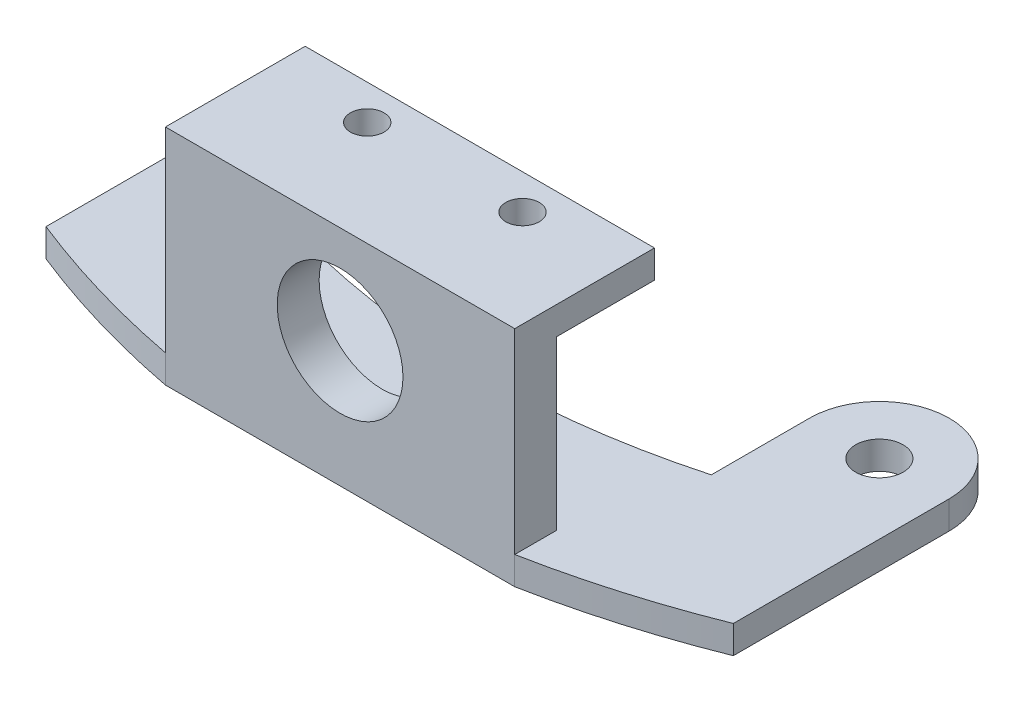
ISO-10303-21;
HEADER;
FILE_DESCRIPTION(('STEP AP214'),'2;1');
FILE_NAME('part.step','',(''),(''),'','','');
FILE_SCHEMA(('AUTOMOTIVE_DESIGN { 1 0 10303 214 1 1 1 1 }'));
ENDSEC;
DATA;
#1=APPLICATION_CONTEXT('core data for automotive mechanical design processes');
#2=APPLICATION_PROTOCOL_DEFINITION('international standard','automotive_design',2000,#1);
#3=PRODUCT_CONTEXT('',#1,'mechanical');
#4=PRODUCT('Part','Part','',(#3));
#5=PRODUCT_RELATED_PRODUCT_CATEGORY('part','',(#4));
#6=PRODUCT_DEFINITION_FORMATION('','',#4);
#7=PRODUCT_DEFINITION_CONTEXT('part definition',#1,'design');
#8=PRODUCT_DEFINITION('design','',#6,#7);
#9=PRODUCT_DEFINITION_SHAPE('','',#8);
#10=(LENGTH_UNIT() NAMED_UNIT(*) SI_UNIT(.MILLI.,.METRE.));
#11=(NAMED_UNIT(*) PLANE_ANGLE_UNIT() SI_UNIT($,.RADIAN.));
#12=(NAMED_UNIT(*) SI_UNIT($,.STERADIAN.) SOLID_ANGLE_UNIT());
#13=UNCERTAINTY_MEASURE_WITH_UNIT(LENGTH_MEASURE(1.E-05),#10,'distance_accuracy_value','');
#14=(GEOMETRIC_REPRESENTATION_CONTEXT(3) GLOBAL_UNCERTAINTY_ASSIGNED_CONTEXT((#13)) GLOBAL_UNIT_ASSIGNED_CONTEXT((#10,
#11,#12)) REPRESENTATION_CONTEXT('',''));
#15=CARTESIAN_POINT('',(0.,0.,0.));
#16=DIRECTION('',(0.,0.,1.));
#17=DIRECTION('',(1.,0.,0.));
#18=AXIS2_PLACEMENT_3D('',#15,#16,#17);
#19=CARTESIAN_POINT('',(-14.5959179422655,-2.,0.));
#20=DIRECTION('',(-1.,0.,0.));
#21=DIRECTION('',(0.,0.,1.));
#22=AXIS2_PLACEMENT_3D('',#19,#20,#21);
#23=PLANE('',#22);
#24=DIRECTION('',(0.,0.,1.));
#25=VECTOR('',#24,1.);
#26=CARTESIAN_POINT('',(-14.5959179422655,0.,0.));
#27=LINE('',#26,#25);
#28=CARTESIAN_POINT('',(-14.5959179422654,0.,46.));
#29=VERTEX_POINT('',#28);
#30=CARTESIAN_POINT('',(-14.5959179422654,0.,53.0279094385462));
#31=VERTEX_POINT('',#30);
#32=EDGE_CURVE('E196',#29,#31,#27,.T.);
#33=ORIENTED_EDGE('',*,*,#32,.T.);
#34=DIRECTION('',(0.,1.,0.));
#35=VECTOR('',#34,1.);
#36=CARTESIAN_POINT('',(-14.5959179422654,-2.,53.0279094385462));
#37=LINE('',#36,#35);
#38=CARTESIAN_POINT('',(-14.5959179422654,-2.,53.0279094385462));
#39=VERTEX_POINT('',#38);
#40=EDGE_CURVE('E11',#39,#31,#37,.T.);
#41=ORIENTED_EDGE('',*,*,#40,.F.);
#42=DIRECTION('',(0.,0.,1.));
#43=VECTOR('',#42,1.);
#44=CARTESIAN_POINT('',(-14.5959179422655,-2.,0.));
#45=LINE('',#44,#43);
#46=CARTESIAN_POINT('',(-14.5959179422654,-2.,46.));
#47=VERTEX_POINT('',#46);
#48=EDGE_CURVE('E197',#47,#39,#45,.T.);
#49=ORIENTED_EDGE('',*,*,#48,.F.);
#50=DIRECTION('',(0.,1.,0.));
#51=VECTOR('',#50,1.);
#52=CARTESIAN_POINT('',(-14.5959179422654,-2.,46.));
#53=LINE('',#52,#51);
#54=EDGE_CURVE('E39',#47,#29,#53,.T.);
#55=ORIENTED_EDGE('',*,*,#54,.T.);
#56=EDGE_LOOP('',(#33,#41,#49,#55));
#57=FACE_BOUND('',#56,.T.);
#58=ADVANCED_FACE('F36',(#57),#23,.F.);
#59=CARTESIAN_POINT('',(0.,-2.,0.));
#60=DIRECTION('',(0.,1.,0.));
#61=DIRECTION('',(0.,0.,1.));
#62=AXIS2_PLACEMENT_3D('',#59,#60,#61);
#63=CYLINDRICAL_SURFACE('',#62,55.);
#64=CARTESIAN_POINT('',(0.,0.,0.));
#65=DIRECTION('',(0.,1.,0.));
#66=DIRECTION('',(0.,0.,1.));
#67=AXIS2_PLACEMENT_3D('',#64,#65,#66);
#68=CIRCLE('',#67,55.);
#69=CARTESIAN_POINT('',(14.5959179422654,0.,53.0279094385462));
#70=VERTEX_POINT('',#69);
#71=EDGE_CURVE('E253',#31,#70,#68,.T.);
#72=ORIENTED_EDGE('',*,*,#71,.T.);
#73=DIRECTION('',(0.,1.,0.));
#74=VECTOR('',#73,1.);
#75=CARTESIAN_POINT('',(14.5959179422654,-2.,53.0279094385462));
#76=LINE('',#75,#74);
#77=CARTESIAN_POINT('',(14.5959179422654,-2.,53.0279094385462));
#78=VERTEX_POINT('',#77);
#79=EDGE_CURVE('E44',#78,#70,#76,.T.);
#80=ORIENTED_EDGE('',*,*,#79,.F.);
#81=CARTESIAN_POINT('',(0.,-2.,0.));
#82=DIRECTION('',(0.,1.,0.));
#83=DIRECTION('',(0.,0.,1.));
#84=AXIS2_PLACEMENT_3D('',#81,#82,#83);
#85=CIRCLE('',#84,55.);
#86=EDGE_CURVE('E223',#39,#78,#85,.T.);
#87=ORIENTED_EDGE('',*,*,#86,.F.);
#88=ORIENTED_EDGE('',*,*,#40,.T.);
#89=EDGE_LOOP('',(#72,#80,#87,#88));
#90=FACE_BOUND('',#89,.T.);
#91=ADVANCED_FACE('F305',(#90),#63,.F.);
#92=CARTESIAN_POINT('',(14.5959179422655,-2.,0.));
#93=DIRECTION('',(-1.,0.,0.));
#94=DIRECTION('',(0.,0.,1.));
#95=AXIS2_PLACEMENT_3D('',#92,#93,#94);
#96=PLANE('',#95);
#97=DIRECTION('',(0.,0.,1.));
#98=VECTOR('',#97,1.);
#99=CARTESIAN_POINT('',(14.5959179422655,0.,0.));
#100=LINE('',#99,#98);
#101=CARTESIAN_POINT('',(14.5959179422656,0.,46.));
#102=VERTEX_POINT('',#101);
#103=EDGE_CURVE('E250',#102,#70,#100,.T.);
#104=ORIENTED_EDGE('',*,*,#103,.F.);
#105=DIRECTION('',(0.,1.,0.));
#106=VECTOR('',#105,1.);
#107=CARTESIAN_POINT('',(14.5959179422656,-2.,46.));
#108=LINE('',#107,#106);
#109=CARTESIAN_POINT('',(14.5959179422656,-2.,46.));
#110=VERTEX_POINT('',#109);
#111=EDGE_CURVE('E262',#110,#102,#108,.T.);
#112=ORIENTED_EDGE('',*,*,#111,.F.);
#113=DIRECTION('',(0.,0.,1.));
#114=VECTOR('',#113,1.);
#115=CARTESIAN_POINT('',(14.5959179422655,-2.,0.));
#116=LINE('',#115,#114);
#117=EDGE_CURVE('E220',#110,#78,#116,.T.);
#118=ORIENTED_EDGE('',*,*,#117,.T.);
#119=ORIENTED_EDGE('',*,*,#79,.T.);
#120=EDGE_LOOP('',(#104,#112,#118,#119));
#121=FACE_BOUND('',#120,.T.);
#122=ADVANCED_FACE('F309',(#121),#96,.T.);
#123=CARTESIAN_POINT('',(19.5959179422654,-2.,46.));
#124=DIRECTION('',(0.,1.,0.));
#125=DIRECTION('',(0.,0.,1.));
#126=AXIS2_PLACEMENT_3D('',#123,#124,#125);
#127=CYLINDRICAL_SURFACE('',#126,4.9999999999997);
#128=CARTESIAN_POINT('',(19.5959179422654,0.,46.));
#129=DIRECTION('',(0.,1.,0.));
#130=DIRECTION('',(0.,0.,1.));
#131=AXIS2_PLACEMENT_3D('',#128,#129,#130);
#132=CIRCLE('',#131,4.9999999999997);
#133=CARTESIAN_POINT('',(24.5959179422653,0.,46.));
#134=VERTEX_POINT('',#133);
#135=EDGE_CURVE('E248',#102,#134,#132,.F.);
#136=ORIENTED_EDGE('',*,*,#135,.T.);
#137=DIRECTION('',(0.,1.,0.));
#138=VECTOR('',#137,1.);
#139=CARTESIAN_POINT('',(24.5959179422653,-2.,46.));
#140=LINE('',#139,#138);
#141=CARTESIAN_POINT('',(24.5959179422653,-2.,46.));
#142=VERTEX_POINT('',#141);
#143=EDGE_CURVE('E264',#142,#134,#140,.T.);
#144=ORIENTED_EDGE('',*,*,#143,.F.);
#145=CARTESIAN_POINT('',(19.5959179422654,-2.,46.));
#146=DIRECTION('',(0.,1.,0.));
#147=DIRECTION('',(0.,0.,1.));
#148=AXIS2_PLACEMENT_3D('',#145,#146,#147);
#149=CIRCLE('',#148,4.9999999999997);
#150=EDGE_CURVE('E218',#110,#142,#149,.F.);
#151=ORIENTED_EDGE('',*,*,#150,.F.);
#152=ORIENTED_EDGE('',*,*,#111,.T.);
#153=EDGE_LOOP('',(#136,#144,#151,#152));
#154=FACE_BOUND('',#153,.T.);
#155=ADVANCED_FACE('F315',(#154),#127,.T.);
#156=CARTESIAN_POINT('',(24.5959179422654,-2.,0.));
#157=DIRECTION('',(-1.,0.,0.));
#158=DIRECTION('',(0.,0.,1.));
#159=AXIS2_PLACEMENT_3D('',#156,#157,#158);
#160=PLANE('',#159);
#161=DIRECTION('',(0.,0.,1.));
#162=VECTOR('',#161,1.);
#163=CARTESIAN_POINT('',(24.5959179422654,0.,0.));
#164=LINE('',#163,#162);
#165=CARTESIAN_POINT('',(24.5959179422654,0.,61.4515322882785));
#166=VERTEX_POINT('',#165);
#167=EDGE_CURVE('E245',#134,#166,#164,.T.);
#168=ORIENTED_EDGE('',*,*,#167,.T.);
#169=DIRECTION('',(0.,1.,0.));
#170=VECTOR('',#169,1.);
#171=CARTESIAN_POINT('',(24.5959179422654,-2.,61.4515322882785));
#172=LINE('',#171,#170);
#173=CARTESIAN_POINT('',(24.5959179422654,-2.,61.4515322882785));
#174=VERTEX_POINT('',#173);
#175=EDGE_CURVE('E267',#174,#166,#172,.T.);
#176=ORIENTED_EDGE('',*,*,#175,.F.);
#177=DIRECTION('',(0.,0.,1.));
#178=VECTOR('',#177,1.);
#179=CARTESIAN_POINT('',(24.5959179422654,-2.,0.));
#180=LINE('',#179,#178);
#181=EDGE_CURVE('E216',#142,#174,#180,.T.);
#182=ORIENTED_EDGE('',*,*,#181,.F.);
#183=ORIENTED_EDGE('',*,*,#143,.T.);
#184=EDGE_LOOP('',(#168,#176,#182,#183));
#185=FACE_BOUND('',#184,.T.);
#186=ADVANCED_FACE('F321',(#185),#160,.F.);
#187=CARTESIAN_POINT('',(0.,-2.,0.));
#188=DIRECTION('',(0.,1.,0.));
#189=DIRECTION('',(0.,0.,1.));
#190=AXIS2_PLACEMENT_3D('',#187,#188,#189);
#191=CYLINDRICAL_SURFACE('',#190,66.1910114743686);
#192=CARTESIAN_POINT('',(0.,0.,0.));
#193=DIRECTION('',(0.,1.,0.));
#194=DIRECTION('',(0.,0.,1.));
#195=AXIS2_PLACEMENT_3D('',#192,#193,#194);
#196=CIRCLE('',#195,66.1910114743686);
#197=CARTESIAN_POINT('',(12.5,0.,64.9999999999999));
#198=VERTEX_POINT('',#197);
#199=EDGE_CURVE('E242',#198,#166,#196,.T.);
#200=ORIENTED_EDGE('',*,*,#199,.F.);
#201=DIRECTION('',(0.,1.,0.));
#202=VECTOR('',#201,1.);
#203=CARTESIAN_POINT('',(12.5,-2.,64.9999999999999));
#204=LINE('',#203,#202);
#205=CARTESIAN_POINT('',(12.5,-2.,64.9999999999999));
#206=VERTEX_POINT('',#205);
#207=EDGE_CURVE('E269',#206,#198,#204,.T.);
#208=ORIENTED_EDGE('',*,*,#207,.F.);
#209=CARTESIAN_POINT('',(0.,-2.,0.));
#210=DIRECTION('',(0.,1.,0.));
#211=DIRECTION('',(0.,0.,1.));
#212=AXIS2_PLACEMENT_3D('',#209,#210,#211);
#213=CIRCLE('',#212,66.1910114743686);
#214=EDGE_CURVE('E213',#206,#174,#213,.T.);
#215=ORIENTED_EDGE('',*,*,#214,.T.);
#216=ORIENTED_EDGE('',*,*,#175,.T.);
#217=EDGE_LOOP('',(#200,#208,#215,#216));
#218=FACE_BOUND('',#217,.T.);
#219=ADVANCED_FACE('F325',(#218),#191,.T.);
#220=CARTESIAN_POINT('',(0.,-2.,64.9999999999999));
#221=DIRECTION('',(0.,0.,1.));
#222=DIRECTION('',(1.,0.,0.));
#223=AXIS2_PLACEMENT_3D('',#220,#221,#222);
#224=PLANE('',#223);
#225=CARTESIAN_POINT('',(0.,7.,64.9999999999999));
#226=DIRECTION('',(0.,0.,1.));
#227=DIRECTION('',(1.,0.,0.));
#228=AXIS2_PLACEMENT_3D('',#225,#226,#227);
#229=CIRCLE('',#228,4.5);
#230=CARTESIAN_POINT('',(4.5,7.,64.9999999999999));
#231=VERTEX_POINT('',#230);
#232=EDGE_CURVE('E475',#231,#231,#229,.T.);
#233=ORIENTED_EDGE('',*,*,#232,.F.);
#234=EDGE_LOOP('',(#233));
#235=FACE_BOUND('',#234,.T.);
#236=ORIENTED_EDGE('',*,*,#207,.T.);
#237=DIRECTION('',(0.,-1.,0.));
#238=VECTOR('',#237,1.);
#239=CARTESIAN_POINT('',(12.5,4.,64.9999999999999));
#240=LINE('',#239,#238);
#241=CARTESIAN_POINT('',(12.5,14.,64.9999999999999));
#242=VERTEX_POINT('',#241);
#243=EDGE_CURVE('E194',#242,#198,#240,.T.);
#244=ORIENTED_EDGE('',*,*,#243,.F.);
#245=DIRECTION('',(1.,0.,0.));
#246=VECTOR('',#245,1.);
#247=CARTESIAN_POINT('',(0.,14.,64.9999999999999));
#248=LINE('',#247,#246);
#249=CARTESIAN_POINT('',(-12.5,14.,64.9999999999999));
#250=VERTEX_POINT('',#249);
#251=EDGE_CURVE('E176',#250,#242,#248,.T.);
#252=ORIENTED_EDGE('',*,*,#251,.F.);
#253=DIRECTION('',(0.,-1.,0.));
#254=VECTOR('',#253,1.);
#255=CARTESIAN_POINT('',(-12.5,4.,64.9999999999999));
#256=LINE('',#255,#254);
#257=CARTESIAN_POINT('',(-12.5,0.,64.9999999999999));
#258=VERTEX_POINT('',#257);
#259=EDGE_CURVE('E190',#250,#258,#256,.T.);
#260=ORIENTED_EDGE('',*,*,#259,.T.);
#261=DIRECTION('',(0.,1.,0.));
#262=VECTOR('',#261,1.);
#263=CARTESIAN_POINT('',(-12.5,-2.,64.9999999999999));
#264=LINE('',#263,#262);
#265=CARTESIAN_POINT('',(-12.5,-2.,64.9999999999999));
#266=VERTEX_POINT('',#265);
#267=EDGE_CURVE('E272',#266,#258,#264,.T.);
#268=ORIENTED_EDGE('',*,*,#267,.F.);
#269=DIRECTION('',(1.,0.,0.));
#270=VECTOR('',#269,1.);
#271=CARTESIAN_POINT('',(0.,-2.,64.9999999999999));
#272=LINE('',#271,#270);
#273=EDGE_CURVE('E210',#266,#206,#272,.T.);
#274=ORIENTED_EDGE('',*,*,#273,.T.);
#275=EDGE_LOOP('',(#236,#244,#252,#260,#268,#274));
#276=FACE_BOUND('',#275,.T.);
#277=ADVANCED_FACE('F329',(#235,#276),#224,.T.);
#278=CARTESIAN_POINT('',(0.,-2.,0.));
#279=DIRECTION('',(0.,1.,0.));
#280=DIRECTION('',(0.,0.,1.));
#281=AXIS2_PLACEMENT_3D('',#278,#279,#280);
#282=CYLINDRICAL_SURFACE('',#281,66.1910114743686);
#283=CARTESIAN_POINT('',(0.,0.,0.));
#284=DIRECTION('',(0.,1.,0.));
#285=DIRECTION('',(0.,0.,1.));
#286=AXIS2_PLACEMENT_3D('',#283,#284,#285);
#287=CIRCLE('',#286,66.1910114743686);
#288=CARTESIAN_POINT('',(-24.5959179422654,0.,61.4515322882785));
#289=VERTEX_POINT('',#288);
#290=EDGE_CURVE('E239',#289,#258,#287,.T.);
#291=ORIENTED_EDGE('',*,*,#290,.F.);
#292=DIRECTION('',(0.,1.,0.));
#293=VECTOR('',#292,1.);
#294=CARTESIAN_POINT('',(-24.5959179422654,-2.,61.4515322882785));
#295=LINE('',#294,#293);
#296=CARTESIAN_POINT('',(-24.5959179422654,-2.,61.4515322882785));
#297=VERTEX_POINT('',#296);
#298=EDGE_CURVE('E275',#297,#289,#295,.T.);
#299=ORIENTED_EDGE('',*,*,#298,.F.);
#300=CARTESIAN_POINT('',(0.,-2.,0.));
#301=DIRECTION('',(0.,1.,0.));
#302=DIRECTION('',(0.,0.,1.));
#303=AXIS2_PLACEMENT_3D('',#300,#301,#302);
#304=CIRCLE('',#303,66.1910114743686);
#305=EDGE_CURVE('E207',#297,#266,#304,.T.);
#306=ORIENTED_EDGE('',*,*,#305,.T.);
#307=ORIENTED_EDGE('',*,*,#267,.T.);
#308=EDGE_LOOP('',(#291,#299,#306,#307));
#309=FACE_BOUND('',#308,.T.);
#310=ADVANCED_FACE('F333',(#309),#282,.T.);
#311=CARTESIAN_POINT('',(-24.5959179422654,-2.,0.));
#312=DIRECTION('',(-1.,0.,0.));
#313=DIRECTION('',(0.,0.,1.));
#314=AXIS2_PLACEMENT_3D('',#311,#312,#313);
#315=PLANE('',#314);
#316=DIRECTION('',(0.,0.,1.));
#317=VECTOR('',#316,1.);
#318=CARTESIAN_POINT('',(-24.5959179422654,0.,0.));
#319=LINE('',#318,#317);
#320=CARTESIAN_POINT('',(-24.5959179422654,0.,46.));
#321=VERTEX_POINT('',#320);
#322=EDGE_CURVE('E236',#321,#289,#319,.T.);
#323=ORIENTED_EDGE('',*,*,#322,.F.);
#324=DIRECTION('',(0.,1.,0.));
#325=VECTOR('',#324,1.);
#326=CARTESIAN_POINT('',(-24.5959179422654,-2.,46.));
#327=LINE('',#326,#325);
#328=CARTESIAN_POINT('',(-24.5959179422654,-2.,46.));
#329=VERTEX_POINT('',#328);
#330=EDGE_CURVE('E276',#329,#321,#327,.T.);
#331=ORIENTED_EDGE('',*,*,#330,.F.);
#332=DIRECTION('',(0.,0.,1.));
#333=VECTOR('',#332,1.);
#334=CARTESIAN_POINT('',(-24.5959179422654,-2.,0.));
#335=LINE('',#334,#333);
#336=EDGE_CURVE('E204',#329,#297,#335,.T.);
#337=ORIENTED_EDGE('',*,*,#336,.T.);
#338=ORIENTED_EDGE('',*,*,#298,.T.);
#339=EDGE_LOOP('',(#323,#331,#337,#338));
#340=FACE_BOUND('',#339,.T.);
#341=ADVANCED_FACE('F300',(#340),#315,.T.);
#342=CARTESIAN_POINT('',(-19.5959179422654,-2.,46.));
#343=DIRECTION('',(0.,1.,0.));
#344=DIRECTION('',(0.,0.,1.));
#345=AXIS2_PLACEMENT_3D('',#342,#343,#344);
#346=CYLINDRICAL_SURFACE('',#345,1.7);
#347=CARTESIAN_POINT('',(-19.5959179422654,-2.,46.));
#348=DIRECTION('',(0.,1.,0.));
#349=DIRECTION('',(0.,0.,1.));
#350=AXIS2_PLACEMENT_3D('',#347,#348,#349);
#351=CIRCLE('',#350,1.7);
#352=CARTESIAN_POINT('',(-19.5959179422654,-2.,47.7));
#353=VERTEX_POINT('',#352);
#354=EDGE_CURVE('E225',#353,#353,#351,.T.);
#355=ORIENTED_EDGE('',*,*,#354,.F.);
#356=EDGE_LOOP('',(#355));
#357=FACE_BOUND('',#356,.T.);
#358=CARTESIAN_POINT('',(-19.5959179422654,0.,46.));
#359=DIRECTION('',(0.,1.,0.));
#360=DIRECTION('',(0.,0.,1.));
#361=AXIS2_PLACEMENT_3D('',#358,#359,#360);
#362=CIRCLE('',#361,1.7);
#363=CARTESIAN_POINT('',(-19.5959179422654,0.,47.7));
#364=VERTEX_POINT('',#363);
#365=EDGE_CURVE('E256',#364,#364,#362,.T.);
#366=ORIENTED_EDGE('',*,*,#365,.T.);
#367=EDGE_LOOP('',(#366));
#368=FACE_BOUND('',#367,.T.);
#369=ADVANCED_FACE('F292',(#357,#368),#346,.F.);
#370=CARTESIAN_POINT('',(-19.5959179422654,-2.,46.));
#371=DIRECTION('',(0.,1.,0.));
#372=DIRECTION('',(0.,0.,1.));
#373=AXIS2_PLACEMENT_3D('',#370,#371,#372);
#374=CYLINDRICAL_SURFACE('',#373,5.);
#375=CARTESIAN_POINT('',(-19.5959179422654,0.,46.));
#376=DIRECTION('',(0.,1.,0.));
#377=DIRECTION('',(0.,0.,1.));
#378=AXIS2_PLACEMENT_3D('',#375,#376,#377);
#379=CIRCLE('',#378,5.);
#380=EDGE_CURVE('E233',#29,#321,#379,.T.);
#381=ORIENTED_EDGE('',*,*,#380,.F.);
#382=ORIENTED_EDGE('',*,*,#54,.F.);
#383=CARTESIAN_POINT('',(-19.5959179422654,-2.,46.));
#384=DIRECTION('',(0.,1.,0.));
#385=DIRECTION('',(0.,0.,1.));
#386=AXIS2_PLACEMENT_3D('',#383,#384,#385);
#387=CIRCLE('',#386,5.);
#388=EDGE_CURVE('E200',#47,#329,#387,.T.);
#389=ORIENTED_EDGE('',*,*,#388,.T.);
#390=ORIENTED_EDGE('',*,*,#330,.T.);
#391=EDGE_LOOP('',(#381,#382,#389,#390));
#392=FACE_BOUND('',#391,.T.);
#393=ADVANCED_FACE('F289',(#392),#374,.T.);
#394=CARTESIAN_POINT('',(19.5959179422654,-2.,46.));
#395=DIRECTION('',(0.,1.,0.));
#396=DIRECTION('',(0.,0.,1.));
#397=AXIS2_PLACEMENT_3D('',#394,#395,#396);
#398=CYLINDRICAL_SURFACE('',#397,1.69999999999969);
#399=CARTESIAN_POINT('',(19.5959179422654,-2.,46.));
#400=DIRECTION('',(0.,1.,0.));
#401=DIRECTION('',(0.,0.,1.));
#402=AXIS2_PLACEMENT_3D('',#399,#400,#401);
#403=CIRCLE('',#402,1.69999999999969);
#404=CARTESIAN_POINT('',(19.5959179422654,-2.,47.6999999999997));
#405=VERTEX_POINT('',#404);
#406=EDGE_CURVE('E228',#405,#405,#403,.F.);
#407=ORIENTED_EDGE('',*,*,#406,.T.);
#408=EDGE_LOOP('',(#407));
#409=FACE_BOUND('',#408,.T.);
#410=CARTESIAN_POINT('',(19.5959179422654,0.,46.));
#411=DIRECTION('',(0.,1.,0.));
#412=DIRECTION('',(0.,0.,1.));
#413=AXIS2_PLACEMENT_3D('',#410,#411,#412);
#414=CIRCLE('',#413,1.69999999999969);
#415=CARTESIAN_POINT('',(19.5959179422654,0.,47.6999999999997));
#416=VERTEX_POINT('',#415);
#417=EDGE_CURVE('E201',#416,#416,#414,.F.);
#418=ORIENTED_EDGE('',*,*,#417,.F.);
#419=EDGE_LOOP('',(#418));
#420=FACE_BOUND('',#419,.T.);
#421=ADVANCED_FACE('F291',(#409,#420),#398,.F.);
#422=CARTESIAN_POINT('',(0.,-2.,0.));
#423=DIRECTION('',(0.,1.,0.));
#424=DIRECTION('',(0.,0.,1.));
#425=AXIS2_PLACEMENT_3D('',#422,#423,#424);
#426=PLANE('',#425);
#427=ORIENTED_EDGE('',*,*,#48,.T.);
#428=ORIENTED_EDGE('',*,*,#86,.T.);
#429=ORIENTED_EDGE('',*,*,#117,.F.);
#430=ORIENTED_EDGE('',*,*,#150,.T.);
#431=ORIENTED_EDGE('',*,*,#181,.T.);
#432=ORIENTED_EDGE('',*,*,#214,.F.);
#433=ORIENTED_EDGE('',*,*,#273,.F.);
#434=ORIENTED_EDGE('',*,*,#305,.F.);
#435=ORIENTED_EDGE('',*,*,#336,.F.);
#436=ORIENTED_EDGE('',*,*,#388,.F.);
#437=EDGE_LOOP('',(#427,#428,#429,#430,#431,#432,#433,#434,#435,#436));
#438=FACE_BOUND('',#437,.T.);
#439=ORIENTED_EDGE('',*,*,#354,.T.);
#440=EDGE_LOOP('',(#439));
#441=FACE_BOUND('',#440,.T.);
#442=ORIENTED_EDGE('',*,*,#406,.F.);
#443=EDGE_LOOP('',(#442));
#444=FACE_BOUND('',#443,.T.);
#445=ADVANCED_FACE('F297',(#438,#441,#444),#426,.F.);
#446=CARTESIAN_POINT('',(0.,0.,0.));
#447=DIRECTION('',(0.,1.,0.));
#448=DIRECTION('',(0.,0.,1.));
#449=AXIS2_PLACEMENT_3D('',#446,#447,#448);
#450=PLANE('',#449);
#451=DIRECTION('',(0.,0.,1.));
#452=VECTOR('',#451,1.);
#453=CARTESIAN_POINT('',(-12.5,0.,61.9999999999999));
#454=LINE('',#453,#452);
#455=CARTESIAN_POINT('',(-12.5,0.,61.9999999999999));
#456=VERTEX_POINT('',#455);
#457=EDGE_CURVE('E187',#456,#258,#454,.T.);
#458=ORIENTED_EDGE('',*,*,#457,.F.);
#459=DIRECTION('',(1.,0.,0.));
#460=VECTOR('',#459,1.);
#461=CARTESIAN_POINT('',(-12.5,0.,61.9999999999999));
#462=LINE('',#461,#460);
#463=CARTESIAN_POINT('',(12.5,0.,61.9999999999999));
#464=VERTEX_POINT('',#463);
#465=EDGE_CURVE('E184',#456,#464,#462,.T.);
#466=ORIENTED_EDGE('',*,*,#465,.T.);
#467=DIRECTION('',(0.,0.,1.));
#468=VECTOR('',#467,1.);
#469=CARTESIAN_POINT('',(12.5,0.,61.9999999999999));
#470=LINE('',#469,#468);
#471=EDGE_CURVE('E181',#464,#198,#470,.T.);
#472=ORIENTED_EDGE('',*,*,#471,.T.);
#473=ORIENTED_EDGE('',*,*,#199,.T.);
#474=ORIENTED_EDGE('',*,*,#167,.F.);
#475=ORIENTED_EDGE('',*,*,#135,.F.);
#476=ORIENTED_EDGE('',*,*,#103,.T.);
#477=ORIENTED_EDGE('',*,*,#71,.F.);
#478=ORIENTED_EDGE('',*,*,#32,.F.);
#479=ORIENTED_EDGE('',*,*,#380,.T.);
#480=ORIENTED_EDGE('',*,*,#322,.T.);
#481=ORIENTED_EDGE('',*,*,#290,.T.);
#482=EDGE_LOOP('',(#458,#466,#472,#473,#474,#475,#476,#477,#478,#479,#480,#481));
#483=FACE_BOUND('',#482,.T.);
#484=ORIENTED_EDGE('',*,*,#365,.F.);
#485=EDGE_LOOP('',(#484));
#486=FACE_BOUND('',#485,.T.);
#487=ORIENTED_EDGE('',*,*,#417,.T.);
#488=EDGE_LOOP('',(#487));
#489=FACE_BOUND('',#488,.T.);
#490=ADVANCED_FACE('F287',(#483,#486,#489),#450,.T.);
#491=CARTESIAN_POINT('',(12.5,4.,61.9999999999999));
#492=DIRECTION('',(1.,0.,0.));
#493=DIRECTION('',(0.,0.,-1.));
#494=AXIS2_PLACEMENT_3D('',#491,#492,#493);
#495=PLANE('',#494);
#496=DIRECTION('',(0.,-1.,0.));
#497=VECTOR('',#496,1.);
#498=CARTESIAN_POINT('',(12.5,4.,61.9999999999999));
#499=LINE('',#498,#497);
#500=CARTESIAN_POINT('',(12.5,12.,61.9999999999999));
#501=VERTEX_POINT('',#500);
#502=EDGE_CURVE('E149',#501,#464,#499,.T.);
#503=ORIENTED_EDGE('',*,*,#502,.F.);
#504=DIRECTION('',(0.,0.,-1.));
#505=VECTOR('',#504,1.);
#506=CARTESIAN_POINT('',(12.5,12.,64.9999999999999));
#507=LINE('',#506,#505);
#508=CARTESIAN_POINT('',(12.5,12.,54.9999999999999));
#509=VERTEX_POINT('',#508);
#510=EDGE_CURVE('E142',#501,#509,#507,.T.);
#511=ORIENTED_EDGE('',*,*,#510,.T.);
#512=DIRECTION('',(0.,1.,0.));
#513=VECTOR('',#512,1.);
#514=CARTESIAN_POINT('',(12.5,12.,54.9999999999999));
#515=LINE('',#514,#513);
#516=CARTESIAN_POINT('',(12.5,14.,54.9999999999999));
#517=VERTEX_POINT('',#516);
#518=EDGE_CURVE('E146',#509,#517,#515,.T.);
#519=ORIENTED_EDGE('',*,*,#518,.T.);
#520=DIRECTION('',(0.,0.,1.));
#521=VECTOR('',#520,1.);
#522=CARTESIAN_POINT('',(12.5,14.,0.));
#523=LINE('',#522,#521);
#524=EDGE_CURVE('E179',#517,#242,#523,.T.);
#525=ORIENTED_EDGE('',*,*,#524,.T.);
#526=ORIENTED_EDGE('',*,*,#243,.T.);
#527=ORIENTED_EDGE('',*,*,#471,.F.);
#528=EDGE_LOOP('',(#503,#511,#519,#525,#526,#527));
#529=FACE_BOUND('',#528,.T.);
#530=ADVANCED_FACE('F144',(#529),#495,.T.);
#531=CARTESIAN_POINT('',(-12.5,4.,61.9999999999999));
#532=DIRECTION('',(0.,0.,-1.));
#533=DIRECTION('',(-1.,0.,0.));
#534=AXIS2_PLACEMENT_3D('',#531,#532,#533);
#535=PLANE('',#534);
#536=CARTESIAN_POINT('',(0.,7.,61.9999999999999));
#537=DIRECTION('',(0.,0.,-1.));
#538=DIRECTION('',(-1.,0.,0.));
#539=AXIS2_PLACEMENT_3D('',#536,#537,#538);
#540=CIRCLE('',#539,4.5);
#541=CARTESIAN_POINT('',(-4.5,7.,61.9999999999999));
#542=VERTEX_POINT('',#541);
#543=EDGE_CURVE('E472',#542,#542,#540,.F.);
#544=ORIENTED_EDGE('',*,*,#543,.T.);
#545=EDGE_LOOP('',(#544));
#546=FACE_BOUND('',#545,.T.);
#547=DIRECTION('',(-1.,0.,0.));
#548=VECTOR('',#547,1.);
#549=CARTESIAN_POINT('',(-12.5,12.,61.9999999999999));
#550=LINE('',#549,#548);
#551=CARTESIAN_POINT('',(-12.5,12.,61.9999999999999));
#552=VERTEX_POINT('',#551);
#553=EDGE_CURVE('E52',#501,#552,#550,.T.);
#554=ORIENTED_EDGE('',*,*,#553,.F.);
#555=ORIENTED_EDGE('',*,*,#502,.T.);
#556=ORIENTED_EDGE('',*,*,#465,.F.);
#557=DIRECTION('',(0.,-1.,0.));
#558=VECTOR('',#557,1.);
#559=CARTESIAN_POINT('',(-12.5,4.,61.9999999999999));
#560=LINE('',#559,#558);
#561=EDGE_CURVE('E57',#552,#456,#560,.T.);
#562=ORIENTED_EDGE('',*,*,#561,.F.);
#563=EDGE_LOOP('',(#554,#555,#556,#562));
#564=FACE_BOUND('',#563,.T.);
#565=ADVANCED_FACE('F358',(#546,#564),#535,.T.);
#566=CARTESIAN_POINT('',(-12.5,4.,61.9999999999999));
#567=DIRECTION('',(1.,0.,0.));
#568=DIRECTION('',(0.,0.,-1.));
#569=AXIS2_PLACEMENT_3D('',#566,#567,#568);
#570=PLANE('',#569);
#571=ORIENTED_EDGE('',*,*,#457,.T.);
#572=ORIENTED_EDGE('',*,*,#259,.F.);
#573=DIRECTION('',(0.,0.,1.));
#574=VECTOR('',#573,1.);
#575=CARTESIAN_POINT('',(-12.5,14.,0.));
#576=LINE('',#575,#574);
#577=CARTESIAN_POINT('',(-12.5,14.,54.9999999999999));
#578=VERTEX_POINT('',#577);
#579=EDGE_CURVE('E173',#578,#250,#576,.T.);
#580=ORIENTED_EDGE('',*,*,#579,.F.);
#581=DIRECTION('',(0.,1.,0.));
#582=VECTOR('',#581,1.);
#583=CARTESIAN_POINT('',(-12.5,12.,54.9999999999999));
#584=LINE('',#583,#582);
#585=CARTESIAN_POINT('',(-12.5,12.,54.9999999999999));
#586=VERTEX_POINT('',#585);
#587=EDGE_CURVE('E161',#586,#578,#584,.T.);
#588=ORIENTED_EDGE('',*,*,#587,.F.);
#589=DIRECTION('',(0.,0.,1.));
#590=VECTOR('',#589,1.);
#591=CARTESIAN_POINT('',(-12.5,12.,64.9999999999999));
#592=LINE('',#591,#590);
#593=EDGE_CURVE('E153',#586,#552,#592,.T.);
#594=ORIENTED_EDGE('',*,*,#593,.T.);
#595=ORIENTED_EDGE('',*,*,#561,.T.);
#596=EDGE_LOOP('',(#571,#572,#580,#588,#594,#595));
#597=FACE_BOUND('',#596,.T.);
#598=ADVANCED_FACE('F357',(#597),#570,.F.);
#599=CARTESIAN_POINT('',(0.,14.,0.));
#600=DIRECTION('',(0.,1.,0.));
#601=DIRECTION('',(0.,0.,1.));
#602=AXIS2_PLACEMENT_3D('',#599,#600,#601);
#603=PLANE('',#602);
#604=ORIENTED_EDGE('',*,*,#579,.T.);
#605=ORIENTED_EDGE('',*,*,#251,.T.);
#606=ORIENTED_EDGE('',*,*,#524,.F.);
#607=DIRECTION('',(-1.,0.,0.));
#608=VECTOR('',#607,1.);
#609=CARTESIAN_POINT('',(-12.5,14.,54.9999999999999));
#610=LINE('',#609,#608);
#611=EDGE_CURVE('E160',#517,#578,#610,.T.);
#612=ORIENTED_EDGE('',*,*,#611,.T.);
#613=EDGE_LOOP('',(#604,#605,#606,#612));
#614=FACE_BOUND('',#613,.T.);
#615=CARTESIAN_POINT('',(-5.55625,14.,57.4999999999999));
#616=DIRECTION('',(0.,1.,0.));
#617=DIRECTION('',(0.,0.,-1.));
#618=AXIS2_PLACEMENT_3D('',#615,#616,#617);
#619=CIRCLE('',#618,1.2);
#620=CARTESIAN_POINT('',(-5.55625,14.,56.2999999999999));
#621=VERTEX_POINT('',#620);
#622=EDGE_CURVE('E476',#621,#621,#619,.T.);
#623=ORIENTED_EDGE('',*,*,#622,.F.);
#624=EDGE_LOOP('',(#623));
#625=FACE_BOUND('',#624,.T.);
#626=CARTESIAN_POINT('',(5.55625,14.,57.4999999999999));
#627=DIRECTION('',(0.,1.,0.));
#628=DIRECTION('',(0.,0.,1.));
#629=AXIS2_PLACEMENT_3D('',#626,#627,#628);
#630=CIRCLE('',#629,1.2);
#631=CARTESIAN_POINT('',(5.55625,14.,58.6999999999999));
#632=VERTEX_POINT('',#631);
#633=EDGE_CURVE('E484',#632,#632,#630,.T.);
#634=ORIENTED_EDGE('',*,*,#633,.F.);
#635=EDGE_LOOP('',(#634));
#636=FACE_BOUND('',#635,.T.);
#637=ADVANCED_FACE('F354',(#614,#625,#636),#603,.T.);
#638=CARTESIAN_POINT('',(-12.5,12.,54.9999999999999));
#639=DIRECTION('',(0.,0.,-1.));
#640=DIRECTION('',(-1.,0.,0.));
#641=AXIS2_PLACEMENT_3D('',#638,#639,#640);
#642=PLANE('',#641);
#643=ORIENTED_EDGE('',*,*,#611,.F.);
#644=ORIENTED_EDGE('',*,*,#518,.F.);
#645=DIRECTION('',(-1.,0.,0.));
#646=VECTOR('',#645,1.);
#647=CARTESIAN_POINT('',(-12.5,12.,54.9999999999999));
#648=LINE('',#647,#646);
#649=EDGE_CURVE('E152',#509,#586,#648,.T.);
#650=ORIENTED_EDGE('',*,*,#649,.T.);
#651=ORIENTED_EDGE('',*,*,#587,.T.);
#652=EDGE_LOOP('',(#643,#644,#650,#651));
#653=FACE_BOUND('',#652,.T.);
#654=ADVANCED_FACE('F157',(#653),#642,.T.);
#655=CARTESIAN_POINT('',(0.,12.,0.));
#656=DIRECTION('',(0.,-1.,0.));
#657=DIRECTION('',(0.,0.,-1.));
#658=AXIS2_PLACEMENT_3D('',#655,#656,#657);
#659=PLANE('',#658);
#660=CARTESIAN_POINT('',(-5.55625,12.,57.4999999999999));
#661=DIRECTION('',(0.,1.,0.));
#662=DIRECTION('',(0.,0.,-1.));
#663=AXIS2_PLACEMENT_3D('',#660,#661,#662);
#664=CIRCLE('',#663,1.2);
#665=CARTESIAN_POINT('',(-5.55625,12.,56.2999999999999));
#666=VERTEX_POINT('',#665);
#667=EDGE_CURVE('E479',#666,#666,#664,.T.);
#668=ORIENTED_EDGE('',*,*,#667,.T.);
#669=EDGE_LOOP('',(#668));
#670=FACE_BOUND('',#669,.T.);
#671=CARTESIAN_POINT('',(5.55625,12.,57.4999999999999));
#672=DIRECTION('',(0.,1.,0.));
#673=DIRECTION('',(0.,0.,1.));
#674=AXIS2_PLACEMENT_3D('',#671,#672,#673);
#675=CIRCLE('',#674,1.2);
#676=CARTESIAN_POINT('',(5.55625,12.,58.6999999999999));
#677=VERTEX_POINT('',#676);
#678=EDGE_CURVE('E170',#677,#677,#675,.T.);
#679=ORIENTED_EDGE('',*,*,#678,.T.);
#680=EDGE_LOOP('',(#679));
#681=FACE_BOUND('',#680,.T.);
#682=ORIENTED_EDGE('',*,*,#510,.F.);
#683=ORIENTED_EDGE('',*,*,#553,.T.);
#684=ORIENTED_EDGE('',*,*,#593,.F.);
#685=ORIENTED_EDGE('',*,*,#649,.F.);
#686=EDGE_LOOP('',(#682,#683,#684,#685));
#687=FACE_BOUND('',#686,.T.);
#688=ADVANCED_FACE('F164',(#670,#681,#687),#659,.T.);
#689=CARTESIAN_POINT('',(5.55625,12.,57.4999999999999));
#690=DIRECTION('',(0.,1.,0.));
#691=DIRECTION('',(0.,0.,1.));
#692=AXIS2_PLACEMENT_3D('',#689,#690,#691);
#693=CYLINDRICAL_SURFACE('',#692,1.2);
#694=ORIENTED_EDGE('',*,*,#678,.F.);
#695=EDGE_LOOP('',(#694));
#696=FACE_BOUND('',#695,.T.);
#697=ORIENTED_EDGE('',*,*,#633,.T.);
#698=EDGE_LOOP('',(#697));
#699=FACE_BOUND('',#698,.T.);
#700=ADVANCED_FACE('F423',(#696,#699),#693,.F.);
#701=CARTESIAN_POINT('',(-5.55625,12.,57.4999999999999));
#702=DIRECTION('',(0.,1.,0.));
#703=DIRECTION('',(0.,0.,1.));
#704=AXIS2_PLACEMENT_3D('',#701,#702,#703);
#705=CYLINDRICAL_SURFACE('',#704,1.2);
#706=ORIENTED_EDGE('',*,*,#667,.F.);
#707=EDGE_LOOP('',(#706));
#708=FACE_BOUND('',#707,.T.);
#709=ORIENTED_EDGE('',*,*,#622,.T.);
#710=EDGE_LOOP('',(#709));
#711=FACE_BOUND('',#710,.T.);
#712=ADVANCED_FACE('F433',(#708,#711),#705,.F.);
#713=CARTESIAN_POINT('',(0.,7.,40.999));
#714=DIRECTION('',(0.,0.,1.));
#715=DIRECTION('',(1.,0.,0.));
#716=AXIS2_PLACEMENT_3D('',#713,#714,#715);
#717=CYLINDRICAL_SURFACE('',#716,4.5);
#718=ORIENTED_EDGE('',*,*,#543,.F.);
#719=EDGE_LOOP('',(#718));
#720=FACE_BOUND('',#719,.T.);
#721=ORIENTED_EDGE('',*,*,#232,.T.);
#722=EDGE_LOOP('',(#721));
#723=FACE_BOUND('',#722,.T.);
#724=ADVANCED_FACE('F443',(#720,#723),#717,.F.);
#725=CLOSED_SHELL('',(#58,#91,#122,#155,#186,#219,#277,#310,#341,#369,#393,#421,#445,#490,#530,
#565,#598,#637,#654,#688,#700,#712,#724));
#726=MANIFOLD_SOLID_BREP('B2',#725);
#727=ADVANCED_BREP_SHAPE_REPRESENTATION('',(#18,#726),#14);
#728=SHAPE_DEFINITION_REPRESENTATION(#9,#727);
ENDSEC;
END-ISO-10303-21;
